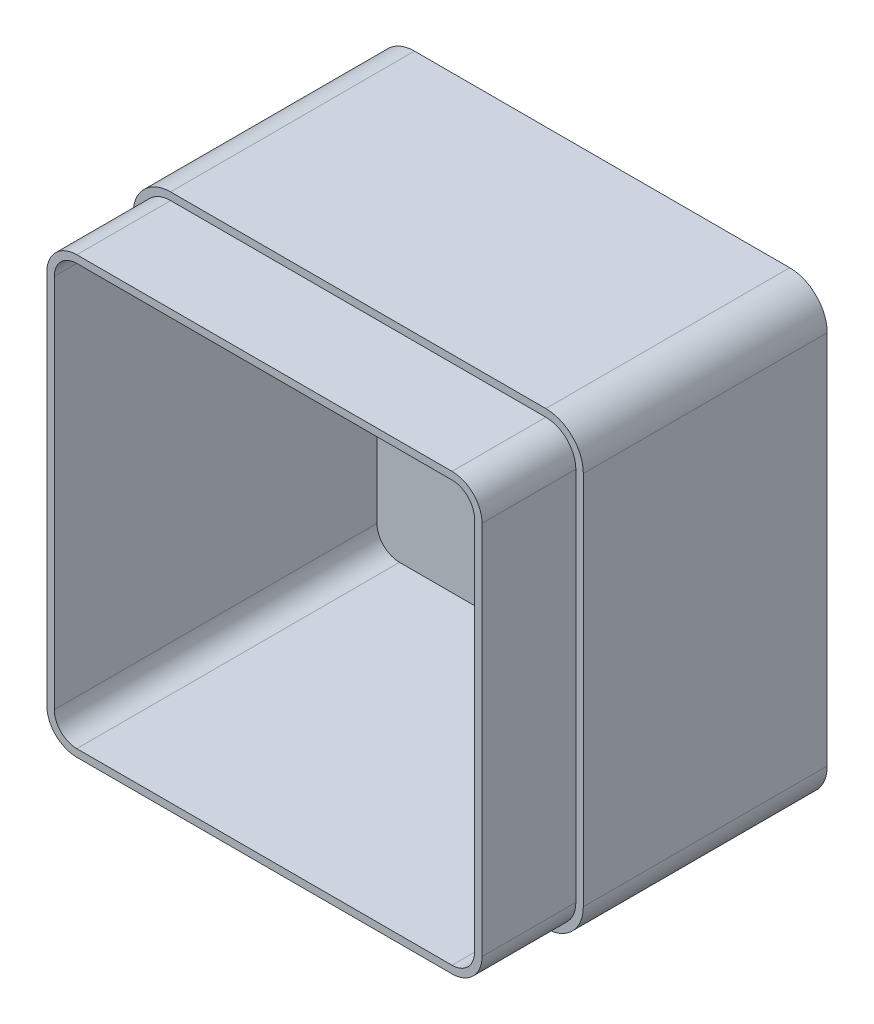
ISO-10303-21;
HEADER;
FILE_DESCRIPTION(('STEP AP214'),'2;1');
FILE_NAME('part.step','',(''),(''),'','','');
FILE_SCHEMA(('AUTOMOTIVE_DESIGN { 1 0 10303 214 1 1 1 1 }'));
ENDSEC;
DATA;
#1=APPLICATION_CONTEXT('core data for automotive mechanical design processes');
#2=APPLICATION_PROTOCOL_DEFINITION('international standard','automotive_design',2000,#1);
#3=PRODUCT_CONTEXT('',#1,'mechanical');
#4=PRODUCT('Part','Part','',(#3));
#5=PRODUCT_RELATED_PRODUCT_CATEGORY('part','',(#4));
#6=PRODUCT_DEFINITION_FORMATION('','',#4);
#7=PRODUCT_DEFINITION_CONTEXT('part definition',#1,'design');
#8=PRODUCT_DEFINITION('design','',#6,#7);
#9=PRODUCT_DEFINITION_SHAPE('','',#8);
#10=(LENGTH_UNIT() NAMED_UNIT(*) SI_UNIT(.MILLI.,.METRE.));
#11=(NAMED_UNIT(*) PLANE_ANGLE_UNIT() SI_UNIT($,.RADIAN.));
#12=(NAMED_UNIT(*) SI_UNIT($,.STERADIAN.) SOLID_ANGLE_UNIT());
#13=UNCERTAINTY_MEASURE_WITH_UNIT(LENGTH_MEASURE(1.E-05),#10,'distance_accuracy_value','');
#14=(GEOMETRIC_REPRESENTATION_CONTEXT(3) GLOBAL_UNCERTAINTY_ASSIGNED_CONTEXT((#13)) GLOBAL_UNIT_ASSIGNED_CONTEXT((#10,
#11,#12)) REPRESENTATION_CONTEXT('',''));
#15=CARTESIAN_POINT('',(0.,0.,0.));
#16=DIRECTION('',(0.,0.,1.));
#17=DIRECTION('',(1.,0.,0.));
#18=AXIS2_PLACEMENT_3D('',#15,#16,#17);
#19=CARTESIAN_POINT('',(0.,120.,90.));
#20=DIRECTION('',(0.,0.,-1.));
#21=DIRECTION('',(-1.,0.,0.));
#22=AXIS2_PLACEMENT_3D('',#19,#20,#21);
#23=PLANE('',#22);
#24=DIRECTION('',(1.,0.,0.));
#25=VECTOR('',#24,1.);
#26=CARTESIAN_POINT('',(0.,4.,90.));
#27=LINE('',#26,#25);
#28=CARTESIAN_POINT('',(9.99999999999999,4.,90.));
#29=VERTEX_POINT('',#28);
#30=CARTESIAN_POINT('',(110.,4.,90.));
#31=VERTEX_POINT('',#30);
#32=EDGE_CURVE('E327',#29,#31,#27,.T.);
#33=ORIENTED_EDGE('',*,*,#32,.F.);
#34=CARTESIAN_POINT('',(9.99999999999999,10.,90.));
#35=DIRECTION('',(0.,0.,-1.));
#36=DIRECTION('',(-1.,0.,0.));
#37=AXIS2_PLACEMENT_3D('',#34,#35,#36);
#38=CIRCLE('',#37,6.);
#39=CARTESIAN_POINT('',(4.,10.,90.));
#40=VERTEX_POINT('',#39);
#41=EDGE_CURVE('E328',#40,#29,#38,.F.);
#42=ORIENTED_EDGE('',*,*,#41,.F.);
#43=DIRECTION('',(0.,-1.,0.));
#44=VECTOR('',#43,1.);
#45=CARTESIAN_POINT('',(3.99999999999997,120.,90.));
#46=LINE('',#45,#44);
#47=CARTESIAN_POINT('',(3.99999999999997,110.,90.));
#48=VERTEX_POINT('',#47);
#49=EDGE_CURVE('E309',#48,#40,#46,.T.);
#50=ORIENTED_EDGE('',*,*,#49,.F.);
#51=CARTESIAN_POINT('',(9.99999999999997,110.,90.));
#52=DIRECTION('',(0.,0.,-1.));
#53=DIRECTION('',(-1.,0.,0.));
#54=AXIS2_PLACEMENT_3D('',#51,#52,#53);
#55=CIRCLE('',#54,6.);
#56=CARTESIAN_POINT('',(9.99999999999997,116.,90.));
#57=VERTEX_POINT('',#56);
#58=EDGE_CURVE('E313',#57,#48,#55,.F.);
#59=ORIENTED_EDGE('',*,*,#58,.F.);
#60=DIRECTION('',(-1.,0.,0.));
#61=VECTOR('',#60,1.);
#62=CARTESIAN_POINT('',(0.,116.,90.));
#63=LINE('',#62,#61);
#64=CARTESIAN_POINT('',(110.,116.,90.));
#65=VERTEX_POINT('',#64);
#66=EDGE_CURVE('E320',#65,#57,#63,.T.);
#67=ORIENTED_EDGE('',*,*,#66,.F.);
#68=CARTESIAN_POINT('',(110.,110.,90.));
#69=DIRECTION('',(0.,0.,-1.));
#70=DIRECTION('',(-1.,0.,0.));
#71=AXIS2_PLACEMENT_3D('',#68,#69,#70);
#72=CIRCLE('',#71,6.);
#73=CARTESIAN_POINT('',(116.,110.,90.));
#74=VERTEX_POINT('',#73);
#75=EDGE_CURVE('E330',#74,#65,#72,.F.);
#76=ORIENTED_EDGE('',*,*,#75,.F.);
#77=DIRECTION('',(0.,1.,0.));
#78=VECTOR('',#77,1.);
#79=CARTESIAN_POINT('',(116.,120.,90.));
#80=LINE('',#79,#78);
#81=CARTESIAN_POINT('',(116.,10.,90.));
#82=VERTEX_POINT('',#81);
#83=EDGE_CURVE('E333',#82,#74,#80,.T.);
#84=ORIENTED_EDGE('',*,*,#83,.F.);
#85=CARTESIAN_POINT('',(110.,10.,90.));
#86=DIRECTION('',(0.,0.,-1.));
#87=DIRECTION('',(-1.,0.,0.));
#88=AXIS2_PLACEMENT_3D('',#85,#86,#87);
#89=CIRCLE('',#88,6.);
#90=EDGE_CURVE('E291',#31,#82,#89,.F.);
#91=ORIENTED_EDGE('',*,*,#90,.F.);
#92=EDGE_LOOP('',(#33,#42,#50,#59,#67,#76,#84,#91));
#93=FACE_BOUND('',#92,.T.);
#94=CARTESIAN_POINT('',(9.99999999999999,10.,90.));
#95=DIRECTION('',(0.,0.,1.));
#96=DIRECTION('',(1.,0.,0.));
#97=AXIS2_PLACEMENT_3D('',#94,#95,#96);
#98=CIRCLE('',#97,8.);
#99=CARTESIAN_POINT('',(2.,9.99999999999999,90.));
#100=VERTEX_POINT('',#99);
#101=CARTESIAN_POINT('',(9.99999999999999,2.,90.));
#102=VERTEX_POINT('',#101);
#103=EDGE_CURVE('E237',#100,#102,#98,.T.);
#104=ORIENTED_EDGE('',*,*,#103,.T.);
#105=DIRECTION('',(1.,0.,0.));
#106=VECTOR('',#105,1.);
#107=CARTESIAN_POINT('',(9.99999999999999,2.,90.));
#108=LINE('',#107,#106);
#109=CARTESIAN_POINT('',(110.,2.,90.));
#110=VERTEX_POINT('',#109);
#111=EDGE_CURVE('E197',#102,#110,#108,.T.);
#112=ORIENTED_EDGE('',*,*,#111,.T.);
#113=CARTESIAN_POINT('',(110.,10.,90.));
#114=DIRECTION('',(0.,0.,1.));
#115=DIRECTION('',(1.,0.,0.));
#116=AXIS2_PLACEMENT_3D('',#113,#114,#115);
#117=CIRCLE('',#116,7.99999999999999);
#118=CARTESIAN_POINT('',(118.,10.,90.));
#119=VERTEX_POINT('',#118);
#120=EDGE_CURVE('E46',#110,#119,#117,.T.);
#121=ORIENTED_EDGE('',*,*,#120,.T.);
#122=DIRECTION('',(0.,1.,0.));
#123=VECTOR('',#122,1.);
#124=CARTESIAN_POINT('',(118.,10.,90.));
#125=LINE('',#124,#123);
#126=CARTESIAN_POINT('',(118.,110.,90.));
#127=VERTEX_POINT('',#126);
#128=EDGE_CURVE('E241',#119,#127,#125,.T.);
#129=ORIENTED_EDGE('',*,*,#128,.T.);
#130=CARTESIAN_POINT('',(110.,110.,90.));
#131=DIRECTION('',(0.,0.,1.));
#132=DIRECTION('',(1.,0.,0.));
#133=AXIS2_PLACEMENT_3D('',#130,#131,#132);
#134=CIRCLE('',#133,7.99999999999999);
#135=CARTESIAN_POINT('',(110.,118.,90.));
#136=VERTEX_POINT('',#135);
#137=EDGE_CURVE('E244',#127,#136,#134,.T.);
#138=ORIENTED_EDGE('',*,*,#137,.T.);
#139=DIRECTION('',(-1.,0.,0.));
#140=VECTOR('',#139,1.);
#141=CARTESIAN_POINT('',(110.,118.,90.));
#142=LINE('',#141,#140);
#143=CARTESIAN_POINT('',(9.99999999999997,118.,90.));
#144=VERTEX_POINT('',#143);
#145=EDGE_CURVE('E247',#136,#144,#142,.T.);
#146=ORIENTED_EDGE('',*,*,#145,.T.);
#147=CARTESIAN_POINT('',(9.99999999999997,110.,90.));
#148=DIRECTION('',(0.,0.,1.));
#149=DIRECTION('',(1.,0.,0.));
#150=AXIS2_PLACEMENT_3D('',#147,#148,#149);
#151=CIRCLE('',#150,7.99999999999999);
#152=CARTESIAN_POINT('',(1.99999999999998,110.,90.));
#153=VERTEX_POINT('',#152);
#154=EDGE_CURVE('E220',#144,#153,#151,.T.);
#155=ORIENTED_EDGE('',*,*,#154,.T.);
#156=DIRECTION('',(0.,-1.,0.));
#157=VECTOR('',#156,1.);
#158=CARTESIAN_POINT('',(1.99999999999998,110.,90.));
#159=LINE('',#158,#157);
#160=EDGE_CURVE('E217',#153,#100,#159,.T.);
#161=ORIENTED_EDGE('',*,*,#160,.T.);
#162=EDGE_LOOP('',(#104,#112,#121,#129,#138,#146,#155,#161));
#163=FACE_BOUND('',#162,.T.);
#164=ADVANCED_FACE('F31',(#93,#163),#23,.F.);
#165=CARTESIAN_POINT('',(4.,0.,90.));
#166=DIRECTION('',(1.,0.,0.));
#167=DIRECTION('',(0.,1.,0.));
#168=AXIS2_PLACEMENT_3D('',#165,#166,#167);
#169=PLANE('',#168);
#170=DIRECTION('',(0.,-1.,0.));
#171=VECTOR('',#170,1.);
#172=CARTESIAN_POINT('',(3.99999999999997,120.,4.));
#173=LINE('',#172,#171);
#174=CARTESIAN_POINT('',(3.99999999999997,110.,4.));
#175=VERTEX_POINT('',#174);
#176=CARTESIAN_POINT('',(4.,10.,4.));
#177=VERTEX_POINT('',#176);
#178=EDGE_CURVE('E280',#175,#177,#173,.T.);
#179=ORIENTED_EDGE('',*,*,#178,.F.);
#180=DIRECTION('',(0.,0.,1.));
#181=VECTOR('',#180,1.);
#182=CARTESIAN_POINT('',(3.99999999999997,110.,90.));
#183=LINE('',#182,#181);
#184=EDGE_CURVE('E288',#48,#175,#183,.F.);
#185=ORIENTED_EDGE('',*,*,#184,.F.);
#186=ORIENTED_EDGE('',*,*,#49,.T.);
#187=DIRECTION('',(0.,0.,1.));
#188=VECTOR('',#187,1.);
#189=CARTESIAN_POINT('',(4.,10.,90.));
#190=LINE('',#189,#188);
#191=EDGE_CURVE('E284',#177,#40,#190,.T.);
#192=ORIENTED_EDGE('',*,*,#191,.F.);
#193=EDGE_LOOP('',(#179,#185,#186,#192));
#194=FACE_BOUND('',#193,.T.);
#195=ADVANCED_FACE('F424',(#194),#169,.T.);
#196=CARTESIAN_POINT('',(0.,4.,90.));
#197=DIRECTION('',(0.,1.,0.));
#198=DIRECTION('',(0.,0.,1.));
#199=AXIS2_PLACEMENT_3D('',#196,#197,#198);
#200=PLANE('',#199);
#201=DIRECTION('',(1.,0.,0.));
#202=VECTOR('',#201,1.);
#203=CARTESIAN_POINT('',(0.,4.,4.));
#204=LINE('',#203,#202);
#205=CARTESIAN_POINT('',(9.99999999999999,4.,4.));
#206=VERTEX_POINT('',#205);
#207=CARTESIAN_POINT('',(110.,4.,4.));
#208=VERTEX_POINT('',#207);
#209=EDGE_CURVE('E283',#206,#208,#204,.T.);
#210=ORIENTED_EDGE('',*,*,#209,.F.);
#211=DIRECTION('',(0.,0.,1.));
#212=VECTOR('',#211,1.);
#213=CARTESIAN_POINT('',(9.99999999999999,4.,90.));
#214=LINE('',#213,#212);
#215=EDGE_CURVE('E298',#29,#206,#214,.F.);
#216=ORIENTED_EDGE('',*,*,#215,.F.);
#217=ORIENTED_EDGE('',*,*,#32,.T.);
#218=DIRECTION('',(0.,0.,1.));
#219=VECTOR('',#218,1.);
#220=CARTESIAN_POINT('',(110.,4.,90.));
#221=LINE('',#220,#219);
#222=EDGE_CURVE('E311',#208,#31,#221,.T.);
#223=ORIENTED_EDGE('',*,*,#222,.F.);
#224=EDGE_LOOP('',(#210,#216,#217,#223));
#225=FACE_BOUND('',#224,.T.);
#226=ADVANCED_FACE('F430',(#225),#200,.T.);
#227=CARTESIAN_POINT('',(116.,0.,90.));
#228=DIRECTION('',(-1.,0.,0.));
#229=DIRECTION('',(0.,-1.,0.));
#230=AXIS2_PLACEMENT_3D('',#227,#228,#229);
#231=PLANE('',#230);
#232=ORIENTED_EDGE('',*,*,#83,.T.);
#233=DIRECTION('',(0.,0.,1.));
#234=VECTOR('',#233,1.);
#235=CARTESIAN_POINT('',(116.,110.,90.));
#236=LINE('',#235,#234);
#237=CARTESIAN_POINT('',(116.,110.,4.));
#238=VERTEX_POINT('',#237);
#239=EDGE_CURVE('E318',#238,#74,#236,.T.);
#240=ORIENTED_EDGE('',*,*,#239,.F.);
#241=DIRECTION('',(0.,1.,0.));
#242=VECTOR('',#241,1.);
#243=CARTESIAN_POINT('',(116.,120.,4.));
#244=LINE('',#243,#242);
#245=CARTESIAN_POINT('',(116.,10.,4.));
#246=VERTEX_POINT('',#245);
#247=EDGE_CURVE('E292',#246,#238,#244,.T.);
#248=ORIENTED_EDGE('',*,*,#247,.F.);
#249=DIRECTION('',(0.,0.,1.));
#250=VECTOR('',#249,1.);
#251=CARTESIAN_POINT('',(116.,10.,90.));
#252=LINE('',#251,#250);
#253=EDGE_CURVE('E306',#82,#246,#252,.F.);
#254=ORIENTED_EDGE('',*,*,#253,.F.);
#255=EDGE_LOOP('',(#232,#240,#248,#254));
#256=FACE_BOUND('',#255,.T.);
#257=ADVANCED_FACE('F590',(#256),#231,.T.);
#258=CARTESIAN_POINT('',(0.,116.,90.));
#259=DIRECTION('',(0.,-1.,0.));
#260=DIRECTION('',(0.,0.,-1.));
#261=AXIS2_PLACEMENT_3D('',#258,#259,#260);
#262=PLANE('',#261);
#263=ORIENTED_EDGE('',*,*,#66,.T.);
#264=DIRECTION('',(0.,0.,-1.));
#265=VECTOR('',#264,1.);
#266=CARTESIAN_POINT('',(9.99999999999997,116.,90.));
#267=LINE('',#266,#265);
#268=CARTESIAN_POINT('',(9.99999999999997,116.,4.));
#269=VERTEX_POINT('',#268);
#270=EDGE_CURVE('E287',#269,#57,#267,.F.);
#271=ORIENTED_EDGE('',*,*,#270,.F.);
#272=DIRECTION('',(-1.,0.,0.));
#273=VECTOR('',#272,1.);
#274=CARTESIAN_POINT('',(0.,116.,4.));
#275=LINE('',#274,#273);
#276=CARTESIAN_POINT('',(110.,116.,4.));
#277=VERTEX_POINT('',#276);
#278=EDGE_CURVE('E295',#277,#269,#275,.T.);
#279=ORIENTED_EDGE('',*,*,#278,.F.);
#280=DIRECTION('',(0.,0.,-1.));
#281=VECTOR('',#280,1.);
#282=CARTESIAN_POINT('',(110.,116.,90.));
#283=LINE('',#282,#281);
#284=EDGE_CURVE('E321',#65,#277,#283,.T.);
#285=ORIENTED_EDGE('',*,*,#284,.F.);
#286=EDGE_LOOP('',(#263,#271,#279,#285));
#287=FACE_BOUND('',#286,.T.);
#288=ADVANCED_FACE('F600',(#287),#262,.T.);
#289=CARTESIAN_POINT('',(0.,120.,4.));
#290=DIRECTION('',(0.,0.,-1.));
#291=DIRECTION('',(-1.,0.,0.));
#292=AXIS2_PLACEMENT_3D('',#289,#290,#291);
#293=PLANE('',#292);
#294=ORIENTED_EDGE('',*,*,#247,.T.);
#295=CARTESIAN_POINT('',(110.,110.,4.));
#296=DIRECTION('',(0.,0.,-1.));
#297=DIRECTION('',(-1.,0.,0.));
#298=AXIS2_PLACEMENT_3D('',#295,#296,#297);
#299=CIRCLE('',#298,6.);
#300=EDGE_CURVE('E303',#277,#238,#299,.T.);
#301=ORIENTED_EDGE('',*,*,#300,.F.);
#302=ORIENTED_EDGE('',*,*,#278,.T.);
#303=CARTESIAN_POINT('',(9.99999999999997,110.,4.));
#304=DIRECTION('',(0.,0.,-1.));
#305=DIRECTION('',(-1.,0.,0.));
#306=AXIS2_PLACEMENT_3D('',#303,#304,#305);
#307=CIRCLE('',#306,6.);
#308=EDGE_CURVE('E304',#175,#269,#307,.T.);
#309=ORIENTED_EDGE('',*,*,#308,.F.);
#310=ORIENTED_EDGE('',*,*,#178,.T.);
#311=CARTESIAN_POINT('',(9.99999999999999,10.,4.));
#312=DIRECTION('',(0.,0.,-1.));
#313=DIRECTION('',(-1.,0.,0.));
#314=AXIS2_PLACEMENT_3D('',#311,#312,#313);
#315=CIRCLE('',#314,6.);
#316=EDGE_CURVE('E299',#206,#177,#315,.T.);
#317=ORIENTED_EDGE('',*,*,#316,.F.);
#318=ORIENTED_EDGE('',*,*,#209,.T.);
#319=CARTESIAN_POINT('',(110.,10.,4.));
#320=DIRECTION('',(0.,0.,-1.));
#321=DIRECTION('',(-1.,0.,0.));
#322=AXIS2_PLACEMENT_3D('',#319,#320,#321);
#323=CIRCLE('',#322,6.);
#324=EDGE_CURVE('E296',#246,#208,#323,.T.);
#325=ORIENTED_EDGE('',*,*,#324,.F.);
#326=EDGE_LOOP('',(#294,#301,#302,#309,#310,#317,#318,#325));
#327=FACE_BOUND('',#326,.T.);
#328=ADVANCED_FACE('F610',(#327),#293,.F.);
#329=CARTESIAN_POINT('',(110.,10.,90.));
#330=DIRECTION('',(0.,0.,-1.));
#331=DIRECTION('',(-1.,0.,0.));
#332=AXIS2_PLACEMENT_3D('',#329,#330,#331);
#333=CYLINDRICAL_SURFACE('',#332,6.);
#334=ORIENTED_EDGE('',*,*,#90,.T.);
#335=ORIENTED_EDGE('',*,*,#253,.T.);
#336=ORIENTED_EDGE('',*,*,#324,.T.);
#337=ORIENTED_EDGE('',*,*,#222,.T.);
#338=EDGE_LOOP('',(#334,#335,#336,#337));
#339=FACE_BOUND('',#338,.T.);
#340=ADVANCED_FACE('F620',(#339),#333,.F.);
#341=CARTESIAN_POINT('',(9.99999999999999,10.,90.));
#342=DIRECTION('',(0.,0.,-1.));
#343=DIRECTION('',(-1.,0.,0.));
#344=AXIS2_PLACEMENT_3D('',#341,#342,#343);
#345=CYLINDRICAL_SURFACE('',#344,6.);
#346=ORIENTED_EDGE('',*,*,#41,.T.);
#347=ORIENTED_EDGE('',*,*,#215,.T.);
#348=ORIENTED_EDGE('',*,*,#316,.T.);
#349=ORIENTED_EDGE('',*,*,#191,.T.);
#350=EDGE_LOOP('',(#346,#347,#348,#349));
#351=FACE_BOUND('',#350,.T.);
#352=ADVANCED_FACE('F630',(#351),#345,.F.);
#353=CARTESIAN_POINT('',(110.,110.,90.));
#354=DIRECTION('',(0.,0.,-1.));
#355=DIRECTION('',(-1.,0.,0.));
#356=AXIS2_PLACEMENT_3D('',#353,#354,#355);
#357=CYLINDRICAL_SURFACE('',#356,6.);
#358=ORIENTED_EDGE('',*,*,#75,.T.);
#359=ORIENTED_EDGE('',*,*,#284,.T.);
#360=ORIENTED_EDGE('',*,*,#300,.T.);
#361=ORIENTED_EDGE('',*,*,#239,.T.);
#362=EDGE_LOOP('',(#358,#359,#360,#361));
#363=FACE_BOUND('',#362,.T.);
#364=ADVANCED_FACE('F640',(#363),#357,.F.);
#365=CARTESIAN_POINT('',(9.99999999999997,110.,90.));
#366=DIRECTION('',(0.,0.,-1.));
#367=DIRECTION('',(-1.,0.,0.));
#368=AXIS2_PLACEMENT_3D('',#365,#366,#367);
#369=CYLINDRICAL_SURFACE('',#368,6.);
#370=ORIENTED_EDGE('',*,*,#58,.T.);
#371=ORIENTED_EDGE('',*,*,#184,.T.);
#372=ORIENTED_EDGE('',*,*,#308,.T.);
#373=ORIENTED_EDGE('',*,*,#270,.T.);
#374=EDGE_LOOP('',(#370,#371,#372,#373));
#375=FACE_BOUND('',#374,.T.);
#376=ADVANCED_FACE('F437',(#375),#369,.F.);
#377=CARTESIAN_POINT('',(60.,60.,65.));
#378=DIRECTION('',(0.,0.,1.));
#379=DIRECTION('',(1.,0.,0.));
#380=AXIS2_PLACEMENT_3D('',#377,#378,#379);
#381=PLANE('',#380);
#382=DIRECTION('',(0.,1.,0.));
#383=VECTOR('',#382,1.);
#384=CARTESIAN_POINT('',(120.,0.,65.));
#385=LINE('',#384,#383);
#386=CARTESIAN_POINT('',(120.,10.,65.));
#387=VERTEX_POINT('',#386);
#388=CARTESIAN_POINT('',(120.,110.,65.));
#389=VERTEX_POINT('',#388);
#390=EDGE_CURVE('E273',#387,#389,#385,.T.);
#391=ORIENTED_EDGE('',*,*,#390,.T.);
#392=CARTESIAN_POINT('',(110.,110.,65.));
#393=DIRECTION('',(0.,0.,1.));
#394=DIRECTION('',(1.,0.,0.));
#395=AXIS2_PLACEMENT_3D('',#392,#393,#394);
#396=CIRCLE('',#395,10.);
#397=CARTESIAN_POINT('',(110.,120.,65.));
#398=VERTEX_POINT('',#397);
#399=EDGE_CURVE('E267',#398,#389,#396,.F.);
#400=ORIENTED_EDGE('',*,*,#399,.F.);
#401=DIRECTION('',(-1.,0.,0.));
#402=VECTOR('',#401,1.);
#403=CARTESIAN_POINT('',(0.,120.,65.));
#404=LINE('',#403,#402);
#405=CARTESIAN_POINT('',(9.99999999999997,120.,65.));
#406=VERTEX_POINT('',#405);
#407=EDGE_CURVE('E54',#398,#406,#404,.T.);
#408=ORIENTED_EDGE('',*,*,#407,.T.);
#409=CARTESIAN_POINT('',(9.99999999999997,110.,65.));
#410=DIRECTION('',(0.,0.,1.));
#411=DIRECTION('',(1.,0.,0.));
#412=AXIS2_PLACEMENT_3D('',#409,#410,#411);
#413=CIRCLE('',#412,10.);
#414=CARTESIAN_POINT('',(0.,110.,65.));
#415=VERTEX_POINT('',#414);
#416=EDGE_CURVE('E12',#415,#406,#413,.F.);
#417=ORIENTED_EDGE('',*,*,#416,.F.);
#418=DIRECTION('',(0.,-1.,0.));
#419=VECTOR('',#418,1.);
#420=CARTESIAN_POINT('',(0.,0.,65.));
#421=LINE('',#420,#419);
#422=CARTESIAN_POINT('',(0.,10.,65.));
#423=VERTEX_POINT('',#422);
#424=EDGE_CURVE('E265',#415,#423,#421,.T.);
#425=ORIENTED_EDGE('',*,*,#424,.T.);
#426=CARTESIAN_POINT('',(9.99999999999999,10.,65.));
#427=DIRECTION('',(0.,0.,1.));
#428=DIRECTION('',(1.,0.,0.));
#429=AXIS2_PLACEMENT_3D('',#426,#427,#428);
#430=CIRCLE('',#429,10.);
#431=CARTESIAN_POINT('',(9.99999999999999,0.,65.));
#432=VERTEX_POINT('',#431);
#433=EDGE_CURVE('E270',#432,#423,#430,.F.);
#434=ORIENTED_EDGE('',*,*,#433,.F.);
#435=DIRECTION('',(1.,0.,0.));
#436=VECTOR('',#435,1.);
#437=CARTESIAN_POINT('',(0.,0.,65.));
#438=LINE('',#437,#436);
#439=CARTESIAN_POINT('',(110.,0.,65.));
#440=VERTEX_POINT('',#439);
#441=EDGE_CURVE('E275',#432,#440,#438,.T.);
#442=ORIENTED_EDGE('',*,*,#441,.T.);
#443=CARTESIAN_POINT('',(110.,10.,65.));
#444=DIRECTION('',(0.,0.,1.));
#445=DIRECTION('',(1.,0.,0.));
#446=AXIS2_PLACEMENT_3D('',#443,#444,#445);
#447=CIRCLE('',#446,10.);
#448=EDGE_CURVE('E277',#387,#440,#447,.F.);
#449=ORIENTED_EDGE('',*,*,#448,.F.);
#450=EDGE_LOOP('',(#391,#400,#408,#417,#425,#434,#442,#449));
#451=FACE_BOUND('',#450,.T.);
#452=DIRECTION('',(0.,-1.,0.));
#453=VECTOR('',#452,1.);
#454=CARTESIAN_POINT('',(1.99999999999998,110.,65.));
#455=LINE('',#454,#453);
#456=CARTESIAN_POINT('',(1.99999999999998,110.,65.));
#457=VERTEX_POINT('',#456);
#458=CARTESIAN_POINT('',(2.,9.99999999999999,65.));
#459=VERTEX_POINT('',#458);
#460=EDGE_CURVE('E203',#457,#459,#455,.T.);
#461=ORIENTED_EDGE('',*,*,#460,.F.);
#462=CARTESIAN_POINT('',(9.99999999999997,110.,65.));
#463=DIRECTION('',(0.,0.,1.));
#464=DIRECTION('',(1.,0.,0.));
#465=AXIS2_PLACEMENT_3D('',#462,#463,#464);
#466=CIRCLE('',#465,7.99999999999999);
#467=CARTESIAN_POINT('',(9.99999999999997,118.,65.));
#468=VERTEX_POINT('',#467);
#469=EDGE_CURVE('E233',#468,#457,#466,.T.);
#470=ORIENTED_EDGE('',*,*,#469,.F.);
#471=DIRECTION('',(-1.,0.,0.));
#472=VECTOR('',#471,1.);
#473=CARTESIAN_POINT('',(110.,118.,65.));
#474=LINE('',#473,#472);
#475=CARTESIAN_POINT('',(110.,118.,65.));
#476=VERTEX_POINT('',#475);
#477=EDGE_CURVE('E230',#476,#468,#474,.T.);
#478=ORIENTED_EDGE('',*,*,#477,.F.);
#479=CARTESIAN_POINT('',(110.,110.,65.));
#480=DIRECTION('',(0.,0.,1.));
#481=DIRECTION('',(1.,0.,0.));
#482=AXIS2_PLACEMENT_3D('',#479,#480,#481);
#483=CIRCLE('',#482,7.99999999999999);
#484=CARTESIAN_POINT('',(118.,110.,65.));
#485=VERTEX_POINT('',#484);
#486=EDGE_CURVE('E227',#485,#476,#483,.T.);
#487=ORIENTED_EDGE('',*,*,#486,.F.);
#488=DIRECTION('',(0.,1.,0.));
#489=VECTOR('',#488,1.);
#490=CARTESIAN_POINT('',(118.,10.,65.));
#491=LINE('',#490,#489);
#492=CARTESIAN_POINT('',(118.,10.,65.));
#493=VERTEX_POINT('',#492);
#494=EDGE_CURVE('E224',#493,#485,#491,.T.);
#495=ORIENTED_EDGE('',*,*,#494,.F.);
#496=CARTESIAN_POINT('',(110.,10.,65.));
#497=DIRECTION('',(0.,0.,1.));
#498=DIRECTION('',(1.,0.,0.));
#499=AXIS2_PLACEMENT_3D('',#496,#497,#498);
#500=CIRCLE('',#499,7.99999999999999);
#501=CARTESIAN_POINT('',(110.,2.,65.));
#502=VERTEX_POINT('',#501);
#503=EDGE_CURVE('E213',#502,#493,#500,.T.);
#504=ORIENTED_EDGE('',*,*,#503,.F.);
#505=DIRECTION('',(1.,0.,0.));
#506=VECTOR('',#505,1.);
#507=CARTESIAN_POINT('',(9.99999999999999,2.,65.));
#508=LINE('',#507,#506);
#509=CARTESIAN_POINT('',(9.99999999999999,2.,65.));
#510=VERTEX_POINT('',#509);
#511=EDGE_CURVE('E195',#510,#502,#508,.T.);
#512=ORIENTED_EDGE('',*,*,#511,.F.);
#513=CARTESIAN_POINT('',(9.99999999999999,10.,65.));
#514=DIRECTION('',(0.,0.,1.));
#515=DIRECTION('',(1.,0.,0.));
#516=AXIS2_PLACEMENT_3D('',#513,#514,#515);
#517=CIRCLE('',#516,8.);
#518=EDGE_CURVE('E209',#459,#510,#517,.T.);
#519=ORIENTED_EDGE('',*,*,#518,.F.);
#520=EDGE_LOOP('',(#461,#470,#478,#487,#495,#504,#512,#519));
#521=FACE_BOUND('',#520,.T.);
#522=ADVANCED_FACE('F208',(#451,#521),#381,.T.);
#523=CARTESIAN_POINT('',(9.99999999999999,10.,65.));
#524=DIRECTION('',(0.,0.,1.));
#525=DIRECTION('',(1.,0.,0.));
#526=AXIS2_PLACEMENT_3D('',#523,#524,#525);
#527=CYLINDRICAL_SURFACE('',#526,8.);
#528=ORIENTED_EDGE('',*,*,#103,.F.);
#529=DIRECTION('',(0.,0.,1.));
#530=VECTOR('',#529,1.);
#531=CARTESIAN_POINT('',(2.,9.99999999999999,65.));
#532=LINE('',#531,#530);
#533=EDGE_CURVE('E216',#459,#100,#532,.T.);
#534=ORIENTED_EDGE('',*,*,#533,.F.);
#535=ORIENTED_EDGE('',*,*,#518,.T.);
#536=DIRECTION('',(0.,0.,1.));
#537=VECTOR('',#536,1.);
#538=CARTESIAN_POINT('',(9.99999999999999,2.,65.));
#539=LINE('',#538,#537);
#540=EDGE_CURVE('E192',#510,#102,#539,.T.);
#541=ORIENTED_EDGE('',*,*,#540,.T.);
#542=EDGE_LOOP('',(#528,#534,#535,#541));
#543=FACE_BOUND('',#542,.T.);
#544=ADVANCED_FACE('F215',(#543),#527,.T.);
#545=CARTESIAN_POINT('',(1.99999999999998,110.,65.));
#546=DIRECTION('',(-1.,0.,0.));
#547=DIRECTION('',(0.,-1.,0.));
#548=AXIS2_PLACEMENT_3D('',#545,#546,#547);
#549=PLANE('',#548);
#550=ORIENTED_EDGE('',*,*,#160,.F.);
#551=DIRECTION('',(0.,0.,1.));
#552=VECTOR('',#551,1.);
#553=CARTESIAN_POINT('',(1.99999999999998,110.,65.));
#554=LINE('',#553,#552);
#555=EDGE_CURVE('E253',#457,#153,#554,.T.);
#556=ORIENTED_EDGE('',*,*,#555,.F.);
#557=ORIENTED_EDGE('',*,*,#460,.T.);
#558=ORIENTED_EDGE('',*,*,#533,.T.);
#559=EDGE_LOOP('',(#550,#556,#557,#558));
#560=FACE_BOUND('',#559,.T.);
#561=ADVANCED_FACE('F483',(#560),#549,.T.);
#562=CARTESIAN_POINT('',(9.99999999999997,110.,65.));
#563=DIRECTION('',(0.,0.,1.));
#564=DIRECTION('',(1.,0.,0.));
#565=AXIS2_PLACEMENT_3D('',#562,#563,#564);
#566=CYLINDRICAL_SURFACE('',#565,7.99999999999999);
#567=ORIENTED_EDGE('',*,*,#154,.F.);
#568=DIRECTION('',(0.,0.,1.));
#569=VECTOR('',#568,1.);
#570=CARTESIAN_POINT('',(9.99999999999997,118.,65.));
#571=LINE('',#570,#569);
#572=EDGE_CURVE('E255',#468,#144,#571,.T.);
#573=ORIENTED_EDGE('',*,*,#572,.F.);
#574=ORIENTED_EDGE('',*,*,#469,.T.);
#575=ORIENTED_EDGE('',*,*,#555,.T.);
#576=EDGE_LOOP('',(#567,#573,#574,#575));
#577=FACE_BOUND('',#576,.T.);
#578=ADVANCED_FACE('F491',(#577),#566,.T.);
#579=CARTESIAN_POINT('',(110.,118.,65.));
#580=DIRECTION('',(0.,1.,0.));
#581=DIRECTION('',(0.,0.,1.));
#582=AXIS2_PLACEMENT_3D('',#579,#580,#581);
#583=PLANE('',#582);
#584=ORIENTED_EDGE('',*,*,#145,.F.);
#585=DIRECTION('',(0.,0.,1.));
#586=VECTOR('',#585,1.);
#587=CARTESIAN_POINT('',(110.,118.,65.));
#588=LINE('',#587,#586);
#589=EDGE_CURVE('E257',#476,#136,#588,.T.);
#590=ORIENTED_EDGE('',*,*,#589,.F.);
#591=ORIENTED_EDGE('',*,*,#477,.T.);
#592=ORIENTED_EDGE('',*,*,#572,.T.);
#593=EDGE_LOOP('',(#584,#590,#591,#592));
#594=FACE_BOUND('',#593,.T.);
#595=ADVANCED_FACE('F500',(#594),#583,.T.);
#596=CARTESIAN_POINT('',(110.,110.,65.));
#597=DIRECTION('',(0.,0.,1.));
#598=DIRECTION('',(1.,0.,0.));
#599=AXIS2_PLACEMENT_3D('',#596,#597,#598);
#600=CYLINDRICAL_SURFACE('',#599,7.99999999999999);
#601=ORIENTED_EDGE('',*,*,#137,.F.);
#602=DIRECTION('',(0.,0.,1.));
#603=VECTOR('',#602,1.);
#604=CARTESIAN_POINT('',(118.,110.,65.));
#605=LINE('',#604,#603);
#606=EDGE_CURVE('E259',#485,#127,#605,.T.);
#607=ORIENTED_EDGE('',*,*,#606,.F.);
#608=ORIENTED_EDGE('',*,*,#486,.T.);
#609=ORIENTED_EDGE('',*,*,#589,.T.);
#610=EDGE_LOOP('',(#601,#607,#608,#609));
#611=FACE_BOUND('',#610,.T.);
#612=ADVANCED_FACE('F509',(#611),#600,.T.);
#613=CARTESIAN_POINT('',(118.,10.,65.));
#614=DIRECTION('',(1.,0.,0.));
#615=DIRECTION('',(0.,1.,0.));
#616=AXIS2_PLACEMENT_3D('',#613,#614,#615);
#617=PLANE('',#616);
#618=ORIENTED_EDGE('',*,*,#128,.F.);
#619=DIRECTION('',(0.,0.,1.));
#620=VECTOR('',#619,1.);
#621=CARTESIAN_POINT('',(118.,10.,65.));
#622=LINE('',#621,#620);
#623=EDGE_CURVE('E261',#493,#119,#622,.T.);
#624=ORIENTED_EDGE('',*,*,#623,.F.);
#625=ORIENTED_EDGE('',*,*,#494,.T.);
#626=ORIENTED_EDGE('',*,*,#606,.T.);
#627=EDGE_LOOP('',(#618,#624,#625,#626));
#628=FACE_BOUND('',#627,.T.);
#629=ADVANCED_FACE('F518',(#628),#617,.T.);
#630=CARTESIAN_POINT('',(110.,10.,65.));
#631=DIRECTION('',(0.,0.,1.));
#632=DIRECTION('',(1.,0.,0.));
#633=AXIS2_PLACEMENT_3D('',#630,#631,#632);
#634=CYLINDRICAL_SURFACE('',#633,7.99999999999999);
#635=ORIENTED_EDGE('',*,*,#120,.F.);
#636=DIRECTION('',(0.,0.,1.));
#637=VECTOR('',#636,1.);
#638=CARTESIAN_POINT('',(110.,2.,65.));
#639=LINE('',#638,#637);
#640=EDGE_CURVE('E202',#502,#110,#639,.T.);
#641=ORIENTED_EDGE('',*,*,#640,.F.);
#642=ORIENTED_EDGE('',*,*,#503,.T.);
#643=ORIENTED_EDGE('',*,*,#623,.T.);
#644=EDGE_LOOP('',(#635,#641,#642,#643));
#645=FACE_BOUND('',#644,.T.);
#646=ADVANCED_FACE('F527',(#645),#634,.T.);
#647=CARTESIAN_POINT('',(9.99999999999999,2.,65.));
#648=DIRECTION('',(0.,-1.,0.));
#649=DIRECTION('',(0.,0.,-1.));
#650=AXIS2_PLACEMENT_3D('',#647,#648,#649);
#651=PLANE('',#650);
#652=ORIENTED_EDGE('',*,*,#111,.F.);
#653=ORIENTED_EDGE('',*,*,#540,.F.);
#654=ORIENTED_EDGE('',*,*,#511,.T.);
#655=ORIENTED_EDGE('',*,*,#640,.T.);
#656=EDGE_LOOP('',(#652,#653,#654,#655));
#657=FACE_BOUND('',#656,.T.);
#658=ADVANCED_FACE('F194',(#657),#651,.T.);
#659=CARTESIAN_POINT('',(0.,120.,0.));
#660=DIRECTION('',(0.,0.,-1.));
#661=DIRECTION('',(-1.,0.,0.));
#662=AXIS2_PLACEMENT_3D('',#659,#660,#661);
#663=PLANE('',#662);
#664=DIRECTION('',(0.,1.,0.));
#665=VECTOR('',#664,1.);
#666=CARTESIAN_POINT('',(120.,0.,0.));
#667=LINE('',#666,#665);
#668=CARTESIAN_POINT('',(120.,10.,0.));
#669=VERTEX_POINT('',#668);
#670=CARTESIAN_POINT('',(120.,110.,0.));
#671=VERTEX_POINT('',#670);
#672=EDGE_CURVE('E346',#669,#671,#667,.T.);
#673=ORIENTED_EDGE('',*,*,#672,.F.);
#674=CARTESIAN_POINT('',(110.,10.,0.));
#675=DIRECTION('',(0.,0.,-1.));
#676=DIRECTION('',(-1.,0.,0.));
#677=AXIS2_PLACEMENT_3D('',#674,#675,#676);
#678=CIRCLE('',#677,10.);
#679=CARTESIAN_POINT('',(110.,0.,0.));
#680=VERTEX_POINT('',#679);
#681=EDGE_CURVE('E363',#669,#680,#678,.T.);
#682=ORIENTED_EDGE('',*,*,#681,.T.);
#683=DIRECTION('',(1.,0.,0.));
#684=VECTOR('',#683,1.);
#685=CARTESIAN_POINT('',(0.,0.,0.));
#686=LINE('',#685,#684);
#687=CARTESIAN_POINT('',(9.99999999999999,0.,0.));
#688=VERTEX_POINT('',#687);
#689=EDGE_CURVE('E343',#688,#680,#686,.T.);
#690=ORIENTED_EDGE('',*,*,#689,.F.);
#691=CARTESIAN_POINT('',(9.99999999999999,10.,0.));
#692=DIRECTION('',(0.,0.,-1.));
#693=DIRECTION('',(-1.,0.,0.));
#694=AXIS2_PLACEMENT_3D('',#691,#692,#693);
#695=CIRCLE('',#694,10.);
#696=CARTESIAN_POINT('',(0.,10.,0.));
#697=VERTEX_POINT('',#696);
#698=EDGE_CURVE('E361',#688,#697,#695,.T.);
#699=ORIENTED_EDGE('',*,*,#698,.T.);
#700=DIRECTION('',(0.,-1.,0.));
#701=VECTOR('',#700,1.);
#702=CARTESIAN_POINT('',(0.,0.,0.));
#703=LINE('',#702,#701);
#704=CARTESIAN_POINT('',(0.,110.,0.));
#705=VERTEX_POINT('',#704);
#706=EDGE_CURVE('E324',#705,#697,#703,.T.);
#707=ORIENTED_EDGE('',*,*,#706,.F.);
#708=CARTESIAN_POINT('',(9.99999999999997,110.,0.));
#709=DIRECTION('',(0.,0.,-1.));
#710=DIRECTION('',(-1.,0.,0.));
#711=AXIS2_PLACEMENT_3D('',#708,#709,#710);
#712=CIRCLE('',#711,10.);
#713=CARTESIAN_POINT('',(9.99999999999997,120.,0.));
#714=VERTEX_POINT('',#713);
#715=EDGE_CURVE('E357',#705,#714,#712,.T.);
#716=ORIENTED_EDGE('',*,*,#715,.T.);
#717=DIRECTION('',(-1.,0.,0.));
#718=VECTOR('',#717,1.);
#719=CARTESIAN_POINT('',(0.,120.,0.));
#720=LINE('',#719,#718);
#721=CARTESIAN_POINT('',(110.,120.,0.));
#722=VERTEX_POINT('',#721);
#723=EDGE_CURVE('E349',#722,#714,#720,.T.);
#724=ORIENTED_EDGE('',*,*,#723,.F.);
#725=CARTESIAN_POINT('',(110.,110.,0.));
#726=DIRECTION('',(0.,0.,-1.));
#727=DIRECTION('',(-1.,0.,0.));
#728=AXIS2_PLACEMENT_3D('',#725,#726,#727);
#729=CIRCLE('',#728,10.);
#730=EDGE_CURVE('E359',#722,#671,#729,.T.);
#731=ORIENTED_EDGE('',*,*,#730,.T.);
#732=EDGE_LOOP('',(#673,#682,#690,#699,#707,#716,#724,#731));
#733=FACE_BOUND('',#732,.T.);
#734=ADVANCED_FACE('F388',(#733),#663,.T.);
#735=CARTESIAN_POINT('',(9.99999999999997,110.,90.));
#736=DIRECTION('',(0.,0.,-1.));
#737=DIRECTION('',(-1.,0.,0.));
#738=AXIS2_PLACEMENT_3D('',#735,#736,#737);
#739=CYLINDRICAL_SURFACE('',#738,10.);
#740=DIRECTION('',(0.,0.,-1.));
#741=VECTOR('',#740,1.);
#742=CARTESIAN_POINT('',(0.,110.,90.));
#743=LINE('',#742,#741);
#744=EDGE_CURVE('E370',#415,#705,#743,.T.);
#745=ORIENTED_EDGE('',*,*,#744,.F.);
#746=ORIENTED_EDGE('',*,*,#416,.T.);
#747=DIRECTION('',(0.,0.,-1.));
#748=VECTOR('',#747,1.);
#749=CARTESIAN_POINT('',(9.99999999999997,120.,90.));
#750=LINE('',#749,#748);
#751=EDGE_CURVE('E375',#714,#406,#750,.F.);
#752=ORIENTED_EDGE('',*,*,#751,.F.);
#753=ORIENTED_EDGE('',*,*,#715,.F.);
#754=EDGE_LOOP('',(#745,#746,#752,#753));
#755=FACE_BOUND('',#754,.T.);
#756=ADVANCED_FACE('F33',(#755),#739,.T.);
#757=CARTESIAN_POINT('',(110.,110.,90.));
#758=DIRECTION('',(0.,0.,-1.));
#759=DIRECTION('',(-1.,0.,0.));
#760=AXIS2_PLACEMENT_3D('',#757,#758,#759);
#761=CYLINDRICAL_SURFACE('',#760,10.);
#762=DIRECTION('',(0.,0.,-1.));
#763=VECTOR('',#762,1.);
#764=CARTESIAN_POINT('',(110.,120.,90.));
#765=LINE('',#764,#763);
#766=EDGE_CURVE('E39',#398,#722,#765,.T.);
#767=ORIENTED_EDGE('',*,*,#766,.F.);
#768=ORIENTED_EDGE('',*,*,#399,.T.);
#769=DIRECTION('',(0.,0.,-1.));
#770=VECTOR('',#769,1.);
#771=CARTESIAN_POINT('',(120.,110.,90.));
#772=LINE('',#771,#770);
#773=EDGE_CURVE('E352',#671,#389,#772,.F.);
#774=ORIENTED_EDGE('',*,*,#773,.F.);
#775=ORIENTED_EDGE('',*,*,#730,.F.);
#776=EDGE_LOOP('',(#767,#768,#774,#775));
#777=FACE_BOUND('',#776,.T.);
#778=ADVANCED_FACE('F385',(#777),#761,.T.);
#779=CARTESIAN_POINT('',(0.,120.,90.));
#780=DIRECTION('',(0.,-1.,0.));
#781=DIRECTION('',(0.,0.,-1.));
#782=AXIS2_PLACEMENT_3D('',#779,#780,#781);
#783=PLANE('',#782);
#784=ORIENTED_EDGE('',*,*,#407,.F.);
#785=ORIENTED_EDGE('',*,*,#766,.T.);
#786=ORIENTED_EDGE('',*,*,#723,.T.);
#787=ORIENTED_EDGE('',*,*,#751,.T.);
#788=EDGE_LOOP('',(#784,#785,#786,#787));
#789=FACE_BOUND('',#788,.T.);
#790=ADVANCED_FACE('F380',(#789),#783,.F.);
#791=CARTESIAN_POINT('',(110.,10.,90.));
#792=DIRECTION('',(0.,0.,-1.));
#793=DIRECTION('',(-1.,0.,0.));
#794=AXIS2_PLACEMENT_3D('',#791,#792,#793);
#795=CYLINDRICAL_SURFACE('',#794,10.);
#796=DIRECTION('',(0.,0.,-1.));
#797=VECTOR('',#796,1.);
#798=CARTESIAN_POINT('',(120.,10.,90.));
#799=LINE('',#798,#797);
#800=EDGE_CURVE('E355',#387,#669,#799,.T.);
#801=ORIENTED_EDGE('',*,*,#800,.F.);
#802=ORIENTED_EDGE('',*,*,#448,.T.);
#803=DIRECTION('',(0.,0.,-1.));
#804=VECTOR('',#803,1.);
#805=CARTESIAN_POINT('',(110.,0.,90.));
#806=LINE('',#805,#804);
#807=EDGE_CURVE('E367',#680,#440,#806,.F.);
#808=ORIENTED_EDGE('',*,*,#807,.F.);
#809=ORIENTED_EDGE('',*,*,#681,.F.);
#810=EDGE_LOOP('',(#801,#802,#808,#809));
#811=FACE_BOUND('',#810,.T.);
#812=ADVANCED_FACE('F409',(#811),#795,.T.);
#813=CARTESIAN_POINT('',(120.,0.,90.));
#814=DIRECTION('',(-1.,0.,0.));
#815=DIRECTION('',(0.,-1.,0.));
#816=AXIS2_PLACEMENT_3D('',#813,#814,#815);
#817=PLANE('',#816);
#818=ORIENTED_EDGE('',*,*,#390,.F.);
#819=ORIENTED_EDGE('',*,*,#800,.T.);
#820=ORIENTED_EDGE('',*,*,#672,.T.);
#821=ORIENTED_EDGE('',*,*,#773,.T.);
#822=EDGE_LOOP('',(#818,#819,#820,#821));
#823=FACE_BOUND('',#822,.T.);
#824=ADVANCED_FACE('F412',(#823),#817,.F.);
#825=CARTESIAN_POINT('',(9.99999999999999,10.,90.));
#826=DIRECTION('',(0.,0.,-1.));
#827=DIRECTION('',(-1.,0.,0.));
#828=AXIS2_PLACEMENT_3D('',#825,#826,#827);
#829=CYLINDRICAL_SURFACE('',#828,10.);
#830=DIRECTION('',(0.,0.,-1.));
#831=VECTOR('',#830,1.);
#832=CARTESIAN_POINT('',(9.99999999999999,0.,90.));
#833=LINE('',#832,#831);
#834=EDGE_CURVE('E365',#432,#688,#833,.T.);
#835=ORIENTED_EDGE('',*,*,#834,.F.);
#836=ORIENTED_EDGE('',*,*,#433,.T.);
#837=DIRECTION('',(0.,0.,-1.));
#838=VECTOR('',#837,1.);
#839=CARTESIAN_POINT('',(0.,10.,90.));
#840=LINE('',#839,#838);
#841=EDGE_CURVE('E372',#697,#423,#840,.F.);
#842=ORIENTED_EDGE('',*,*,#841,.F.);
#843=ORIENTED_EDGE('',*,*,#698,.F.);
#844=EDGE_LOOP('',(#835,#836,#842,#843));
#845=FACE_BOUND('',#844,.T.);
#846=ADVANCED_FACE('F400',(#845),#829,.T.);
#847=CARTESIAN_POINT('',(0.,0.,90.));
#848=DIRECTION('',(0.,1.,0.));
#849=DIRECTION('',(0.,0.,1.));
#850=AXIS2_PLACEMENT_3D('',#847,#848,#849);
#851=PLANE('',#850);
#852=ORIENTED_EDGE('',*,*,#441,.F.);
#853=ORIENTED_EDGE('',*,*,#834,.T.);
#854=ORIENTED_EDGE('',*,*,#689,.T.);
#855=ORIENTED_EDGE('',*,*,#807,.T.);
#856=EDGE_LOOP('',(#852,#853,#854,#855));
#857=FACE_BOUND('',#856,.T.);
#858=ADVANCED_FACE('F404',(#857),#851,.F.);
#859=CARTESIAN_POINT('',(0.,0.,90.));
#860=DIRECTION('',(1.,0.,0.));
#861=DIRECTION('',(0.,1.,0.));
#862=AXIS2_PLACEMENT_3D('',#859,#860,#861);
#863=PLANE('',#862);
#864=ORIENTED_EDGE('',*,*,#424,.F.);
#865=ORIENTED_EDGE('',*,*,#744,.T.);
#866=ORIENTED_EDGE('',*,*,#706,.T.);
#867=ORIENTED_EDGE('',*,*,#841,.T.);
#868=EDGE_LOOP('',(#864,#865,#866,#867));
#869=FACE_BOUND('',#868,.T.);
#870=ADVANCED_FACE('F395',(#869),#863,.F.);
#871=CLOSED_SHELL('',(#164,#195,#226,#257,#288,#328,#340,#352,#364,#376,#522,#544,#561,#578,
#595,#612,#629,#646,#658,#734,#756,#778,#790,#812,#824,#846,#858,#870));
#872=MANIFOLD_SOLID_BREP('B2',#871);
#873=ADVANCED_BREP_SHAPE_REPRESENTATION('',(#18,#872),#14);
#874=SHAPE_DEFINITION_REPRESENTATION(#9,#873);
ENDSEC;
END-ISO-10303-21;
